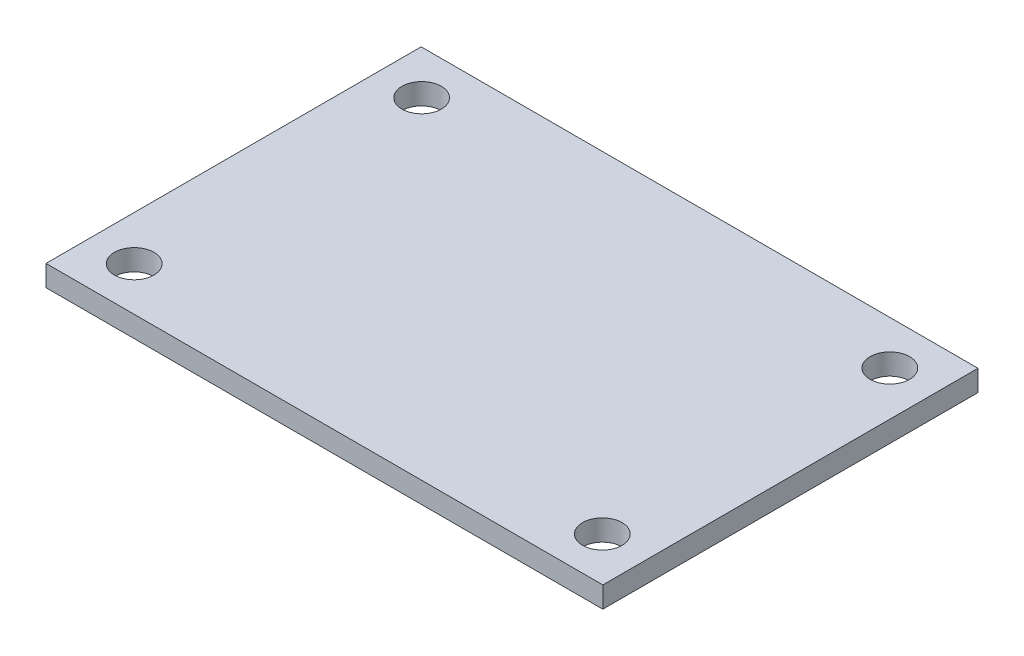
ISO-10303-21;
HEADER;
FILE_DESCRIPTION(('STEP AP214'),'2;1');
FILE_NAME('part.step','',(''),(''),'','','');
FILE_SCHEMA(('AUTOMOTIVE_DESIGN { 1 0 10303 214 1 1 1 1 }'));
ENDSEC;
DATA;
#1=APPLICATION_CONTEXT('core data for automotive mechanical design processes');
#2=APPLICATION_PROTOCOL_DEFINITION('international standard','automotive_design',2000,#1);
#3=PRODUCT_CONTEXT('',#1,'mechanical');
#4=PRODUCT('Part','Part','',(#3));
#5=PRODUCT_RELATED_PRODUCT_CATEGORY('part','',(#4));
#6=PRODUCT_DEFINITION_FORMATION('','',#4);
#7=PRODUCT_DEFINITION_CONTEXT('part definition',#1,'design');
#8=PRODUCT_DEFINITION('design','',#6,#7);
#9=PRODUCT_DEFINITION_SHAPE('','',#8);
#10=(LENGTH_UNIT() NAMED_UNIT(*) SI_UNIT(.MILLI.,.METRE.));
#11=(NAMED_UNIT(*) PLANE_ANGLE_UNIT() SI_UNIT($,.RADIAN.));
#12=(NAMED_UNIT(*) SI_UNIT($,.STERADIAN.) SOLID_ANGLE_UNIT());
#13=UNCERTAINTY_MEASURE_WITH_UNIT(LENGTH_MEASURE(1.E-05),#10,'distance_accuracy_value','');
#14=(GEOMETRIC_REPRESENTATION_CONTEXT(3) GLOBAL_UNCERTAINTY_ASSIGNED_CONTEXT((#13)) GLOBAL_UNIT_ASSIGNED_CONTEXT((#10,
#11,#12)) REPRESENTATION_CONTEXT('',''));
#15=CARTESIAN_POINT('',(0.,0.,0.));
#16=DIRECTION('',(0.,0.,1.));
#17=DIRECTION('',(1.,0.,0.));
#18=AXIS2_PLACEMENT_3D('',#15,#16,#17);
#19=CARTESIAN_POINT('',(0.,1.6,0.));
#20=DIRECTION('',(0.,1.,0.));
#21=DIRECTION('',(0.,0.,1.));
#22=AXIS2_PLACEMENT_3D('',#19,#20,#21);
#23=PLANE('',#22);
#24=CARTESIAN_POINT('',(17.7817,1.6,10.9198));
#25=DIRECTION('',(0.,1.,0.));
#26=DIRECTION('',(0.,0.,1.));
#27=AXIS2_PLACEMENT_3D('',#24,#25,#26);
#28=CIRCLE('',#27,1.5);
#29=CARTESIAN_POINT('',(17.7817,1.6,12.4198));
#30=VERTEX_POINT('',#29);
#31=EDGE_CURVE('E126',#30,#30,#28,.T.);
#32=ORIENTED_EDGE('',*,*,#31,.F.);
#33=EDGE_LOOP('',(#32));
#34=FACE_BOUND('',#33,.T.);
#35=CARTESIAN_POINT('',(-17.7817,1.6,-10.9198));
#36=DIRECTION('',(0.,1.,0.));
#37=DIRECTION('',(0.,0.,1.));
#38=AXIS2_PLACEMENT_3D('',#35,#36,#37);
#39=CIRCLE('',#38,1.5);
#40=CARTESIAN_POINT('',(-17.7817,1.6,-9.4198));
#41=VERTEX_POINT('',#40);
#42=EDGE_CURVE('E105',#41,#41,#39,.T.);
#43=ORIENTED_EDGE('',*,*,#42,.F.);
#44=EDGE_LOOP('',(#43));
#45=FACE_BOUND('',#44,.T.);
#46=DIRECTION('',(0.,0.,1.));
#47=VECTOR('',#46,1.);
#48=CARTESIAN_POINT('',(-21.15,1.6,14.25));
#49=LINE('',#48,#47);
#50=CARTESIAN_POINT('',(-21.15,1.6,-14.25));
#51=VERTEX_POINT('',#50);
#52=CARTESIAN_POINT('',(-21.15,1.6,14.25));
#53=VERTEX_POINT('',#52);
#54=EDGE_CURVE('E90',#51,#53,#49,.T.);
#55=ORIENTED_EDGE('',*,*,#54,.T.);
#56=DIRECTION('',(1.,0.,0.));
#57=VECTOR('',#56,1.);
#58=CARTESIAN_POINT('',(21.15,1.6,14.25));
#59=LINE('',#58,#57);
#60=CARTESIAN_POINT('',(21.15,1.6,14.25));
#61=VERTEX_POINT('',#60);
#62=EDGE_CURVE('E85',#53,#61,#59,.T.);
#63=ORIENTED_EDGE('',*,*,#62,.T.);
#64=DIRECTION('',(0.,0.,-1.));
#65=VECTOR('',#64,1.);
#66=CARTESIAN_POINT('',(21.15,1.6,14.25));
#67=LINE('',#66,#65);
#68=CARTESIAN_POINT('',(21.15,1.6,-14.25));
#69=VERTEX_POINT('',#68);
#70=EDGE_CURVE('E88',#61,#69,#67,.T.);
#71=ORIENTED_EDGE('',*,*,#70,.T.);
#72=DIRECTION('',(-1.,0.,0.));
#73=VECTOR('',#72,1.);
#74=CARTESIAN_POINT('',(21.15,1.6,-14.25));
#75=LINE('',#74,#73);
#76=EDGE_CURVE('E55',#69,#51,#75,.T.);
#77=ORIENTED_EDGE('',*,*,#76,.T.);
#78=EDGE_LOOP('',(#55,#63,#71,#77));
#79=FACE_BOUND('',#78,.T.);
#80=CARTESIAN_POINT('',(17.7817,1.6,-10.9198));
#81=DIRECTION('',(0.,1.,0.));
#82=DIRECTION('',(0.,0.,-1.));
#83=AXIS2_PLACEMENT_3D('',#80,#81,#82);
#84=CIRCLE('',#83,1.5);
#85=CARTESIAN_POINT('',(17.7817,1.6,-12.4198));
#86=VERTEX_POINT('',#85);
#87=EDGE_CURVE('E120',#86,#86,#84,.T.);
#88=ORIENTED_EDGE('',*,*,#87,.F.);
#89=EDGE_LOOP('',(#88));
#90=FACE_BOUND('',#89,.T.);
#91=CARTESIAN_POINT('',(-17.7817,1.6,10.9198));
#92=DIRECTION('',(0.,1.,0.));
#93=DIRECTION('',(0.,0.,-1.));
#94=AXIS2_PLACEMENT_3D('',#91,#92,#93);
#95=CIRCLE('',#94,1.5);
#96=CARTESIAN_POINT('',(-17.7817,1.6,9.41979999999999));
#97=VERTEX_POINT('',#96);
#98=EDGE_CURVE('E132',#97,#97,#95,.T.);
#99=ORIENTED_EDGE('',*,*,#98,.F.);
#100=EDGE_LOOP('',(#99));
#101=FACE_BOUND('',#100,.T.);
#102=ADVANCED_FACE('F38',(#34,#45,#79,#90,#101),#23,.T.);
#103=CARTESIAN_POINT('',(0.,0.,0.));
#104=DIRECTION('',(0.,1.,0.));
#105=DIRECTION('',(0.,0.,1.));
#106=AXIS2_PLACEMENT_3D('',#103,#104,#105);
#107=PLANE('',#106);
#108=DIRECTION('',(0.,0.,1.));
#109=VECTOR('',#108,1.);
#110=CARTESIAN_POINT('',(-21.15,0.,14.25));
#111=LINE('',#110,#109);
#112=CARTESIAN_POINT('',(-21.15,0.,-14.25));
#113=VERTEX_POINT('',#112);
#114=CARTESIAN_POINT('',(-21.15,0.,14.25));
#115=VERTEX_POINT('',#114);
#116=EDGE_CURVE('E102',#113,#115,#111,.T.);
#117=ORIENTED_EDGE('',*,*,#116,.F.);
#118=DIRECTION('',(-1.,0.,0.));
#119=VECTOR('',#118,1.);
#120=CARTESIAN_POINT('',(21.15,0.,-14.25));
#121=LINE('',#120,#119);
#122=CARTESIAN_POINT('',(21.15,0.,-14.25));
#123=VERTEX_POINT('',#122);
#124=EDGE_CURVE('E78',#123,#113,#121,.T.);
#125=ORIENTED_EDGE('',*,*,#124,.F.);
#126=DIRECTION('',(0.,0.,-1.));
#127=VECTOR('',#126,1.);
#128=CARTESIAN_POINT('',(21.15,0.,14.25));
#129=LINE('',#128,#127);
#130=CARTESIAN_POINT('',(21.15,0.,14.25));
#131=VERTEX_POINT('',#130);
#132=EDGE_CURVE('E72',#131,#123,#129,.T.);
#133=ORIENTED_EDGE('',*,*,#132,.F.);
#134=DIRECTION('',(1.,0.,0.));
#135=VECTOR('',#134,1.);
#136=CARTESIAN_POINT('',(21.15,0.,14.25));
#137=LINE('',#136,#135);
#138=EDGE_CURVE('E94',#115,#131,#137,.T.);
#139=ORIENTED_EDGE('',*,*,#138,.F.);
#140=EDGE_LOOP('',(#117,#125,#133,#139));
#141=FACE_BOUND('',#140,.T.);
#142=CARTESIAN_POINT('',(-17.7817,0.,-10.9198));
#143=DIRECTION('',(0.,1.,0.));
#144=DIRECTION('',(0.,0.,1.));
#145=AXIS2_PLACEMENT_3D('',#142,#143,#144);
#146=CIRCLE('',#145,1.5);
#147=CARTESIAN_POINT('',(-17.7817,0.,-9.4198));
#148=VERTEX_POINT('',#147);
#149=EDGE_CURVE('E117',#148,#148,#146,.T.);
#150=ORIENTED_EDGE('',*,*,#149,.T.);
#151=EDGE_LOOP('',(#150));
#152=FACE_BOUND('',#151,.T.);
#153=CARTESIAN_POINT('',(17.7817,0.,-10.9198));
#154=DIRECTION('',(0.,1.,0.));
#155=DIRECTION('',(0.,0.,-1.));
#156=AXIS2_PLACEMENT_3D('',#153,#154,#155);
#157=CIRCLE('',#156,1.5);
#158=CARTESIAN_POINT('',(17.7817,0.,-12.4198));
#159=VERTEX_POINT('',#158);
#160=EDGE_CURVE('E123',#159,#159,#157,.T.);
#161=ORIENTED_EDGE('',*,*,#160,.T.);
#162=EDGE_LOOP('',(#161));
#163=FACE_BOUND('',#162,.T.);
#164=CARTESIAN_POINT('',(17.7817,0.,10.9198));
#165=DIRECTION('',(0.,1.,0.));
#166=DIRECTION('',(0.,0.,1.));
#167=AXIS2_PLACEMENT_3D('',#164,#165,#166);
#168=CIRCLE('',#167,1.5);
#169=CARTESIAN_POINT('',(17.7817,0.,12.4198));
#170=VERTEX_POINT('',#169);
#171=EDGE_CURVE('E129',#170,#170,#168,.T.);
#172=ORIENTED_EDGE('',*,*,#171,.T.);
#173=EDGE_LOOP('',(#172));
#174=FACE_BOUND('',#173,.T.);
#175=CARTESIAN_POINT('',(-17.7817,0.,10.9198));
#176=DIRECTION('',(0.,1.,0.));
#177=DIRECTION('',(0.,0.,-1.));
#178=AXIS2_PLACEMENT_3D('',#175,#176,#177);
#179=CIRCLE('',#178,1.5);
#180=CARTESIAN_POINT('',(-17.7817,0.,9.41979999999999));
#181=VERTEX_POINT('',#180);
#182=EDGE_CURVE('E135',#181,#181,#179,.T.);
#183=ORIENTED_EDGE('',*,*,#182,.T.);
#184=EDGE_LOOP('',(#183));
#185=FACE_BOUND('',#184,.T.);
#186=ADVANCED_FACE('F113',(#141,#152,#163,#174,#185),#107,.F.);
#187=CARTESIAN_POINT('',(-21.15,1.6,14.25));
#188=DIRECTION('',(1.,0.,0.));
#189=DIRECTION('',(0.,0.,-1.));
#190=AXIS2_PLACEMENT_3D('',#187,#188,#189);
#191=PLANE('',#190);
#192=ORIENTED_EDGE('',*,*,#116,.T.);
#193=DIRECTION('',(0.,-1.,0.));
#194=VECTOR('',#193,1.);
#195=CARTESIAN_POINT('',(-21.15,1.6,14.25));
#196=LINE('',#195,#194);
#197=EDGE_CURVE('E11',#53,#115,#196,.T.);
#198=ORIENTED_EDGE('',*,*,#197,.F.);
#199=ORIENTED_EDGE('',*,*,#54,.F.);
#200=DIRECTION('',(0.,-1.,0.));
#201=VECTOR('',#200,1.);
#202=CARTESIAN_POINT('',(-21.15,1.6,-14.25));
#203=LINE('',#202,#201);
#204=EDGE_CURVE('E98',#51,#113,#203,.T.);
#205=ORIENTED_EDGE('',*,*,#204,.T.);
#206=EDGE_LOOP('',(#192,#198,#199,#205));
#207=FACE_BOUND('',#206,.T.);
#208=ADVANCED_FACE('F40',(#207),#191,.F.);
#209=CARTESIAN_POINT('',(21.15,1.6,14.25));
#210=DIRECTION('',(0.,0.,-1.));
#211=DIRECTION('',(-1.,0.,0.));
#212=AXIS2_PLACEMENT_3D('',#209,#210,#211);
#213=PLANE('',#212);
#214=ORIENTED_EDGE('',*,*,#138,.T.);
#215=DIRECTION('',(0.,-1.,0.));
#216=VECTOR('',#215,1.);
#217=CARTESIAN_POINT('',(21.15,1.6,14.25));
#218=LINE('',#217,#216);
#219=EDGE_CURVE('E47',#61,#131,#218,.T.);
#220=ORIENTED_EDGE('',*,*,#219,.F.);
#221=ORIENTED_EDGE('',*,*,#62,.F.);
#222=ORIENTED_EDGE('',*,*,#197,.T.);
#223=EDGE_LOOP('',(#214,#220,#221,#222));
#224=FACE_BOUND('',#223,.T.);
#225=ADVANCED_FACE('F93',(#224),#213,.F.);
#226=CARTESIAN_POINT('',(21.15,1.6,14.25));
#227=DIRECTION('',(-1.,0.,0.));
#228=DIRECTION('',(0.,0.,1.));
#229=AXIS2_PLACEMENT_3D('',#226,#227,#228);
#230=PLANE('',#229);
#231=ORIENTED_EDGE('',*,*,#132,.T.);
#232=DIRECTION('',(0.,-1.,0.));
#233=VECTOR('',#232,1.);
#234=CARTESIAN_POINT('',(21.15,1.6,-14.25));
#235=LINE('',#234,#233);
#236=EDGE_CURVE('E95',#69,#123,#235,.T.);
#237=ORIENTED_EDGE('',*,*,#236,.F.);
#238=ORIENTED_EDGE('',*,*,#70,.F.);
#239=ORIENTED_EDGE('',*,*,#219,.T.);
#240=EDGE_LOOP('',(#231,#237,#238,#239));
#241=FACE_BOUND('',#240,.T.);
#242=ADVANCED_FACE('F96',(#241),#230,.F.);
#243=CARTESIAN_POINT('',(21.15,1.6,-14.25));
#244=DIRECTION('',(0.,0.,1.));
#245=DIRECTION('',(1.,0.,0.));
#246=AXIS2_PLACEMENT_3D('',#243,#244,#245);
#247=PLANE('',#246);
#248=ORIENTED_EDGE('',*,*,#124,.T.);
#249=ORIENTED_EDGE('',*,*,#204,.F.);
#250=ORIENTED_EDGE('',*,*,#76,.F.);
#251=ORIENTED_EDGE('',*,*,#236,.T.);
#252=EDGE_LOOP('',(#248,#249,#250,#251));
#253=FACE_BOUND('',#252,.T.);
#254=ADVANCED_FACE('F110',(#253),#247,.F.);
#255=CARTESIAN_POINT('',(-17.7817,1.6,-10.9198));
#256=DIRECTION('',(0.,-1.,0.));
#257=DIRECTION('',(0.,0.,-1.));
#258=AXIS2_PLACEMENT_3D('',#255,#256,#257);
#259=CYLINDRICAL_SURFACE('',#258,1.5);
#260=ORIENTED_EDGE('',*,*,#42,.T.);
#261=EDGE_LOOP('',(#260));
#262=FACE_BOUND('',#261,.T.);
#263=ORIENTED_EDGE('',*,*,#149,.F.);
#264=EDGE_LOOP('',(#263));
#265=FACE_BOUND('',#264,.T.);
#266=ADVANCED_FACE('F154',(#262,#265),#259,.F.);
#267=CARTESIAN_POINT('',(17.7817,1.6,-10.9198));
#268=DIRECTION('',(0.,-1.,0.));
#269=DIRECTION('',(0.,0.,-1.));
#270=AXIS2_PLACEMENT_3D('',#267,#268,#269);
#271=CYLINDRICAL_SURFACE('',#270,1.5);
#272=ORIENTED_EDGE('',*,*,#87,.T.);
#273=EDGE_LOOP('',(#272));
#274=FACE_BOUND('',#273,.T.);
#275=ORIENTED_EDGE('',*,*,#160,.F.);
#276=EDGE_LOOP('',(#275));
#277=FACE_BOUND('',#276,.T.);
#278=ADVANCED_FACE('F202',(#274,#277),#271,.F.);
#279=CARTESIAN_POINT('',(17.7817,1.6,10.9198));
#280=DIRECTION('',(0.,-1.,0.));
#281=DIRECTION('',(0.,0.,-1.));
#282=AXIS2_PLACEMENT_3D('',#279,#280,#281);
#283=CYLINDRICAL_SURFACE('',#282,1.5);
#284=ORIENTED_EDGE('',*,*,#31,.T.);
#285=EDGE_LOOP('',(#284));
#286=FACE_BOUND('',#285,.T.);
#287=ORIENTED_EDGE('',*,*,#171,.F.);
#288=EDGE_LOOP('',(#287));
#289=FACE_BOUND('',#288,.T.);
#290=ADVANCED_FACE('F210',(#286,#289),#283,.F.);
#291=CARTESIAN_POINT('',(-17.7817,1.6,10.9198));
#292=DIRECTION('',(0.,-1.,0.));
#293=DIRECTION('',(0.,0.,-1.));
#294=AXIS2_PLACEMENT_3D('',#291,#292,#293);
#295=CYLINDRICAL_SURFACE('',#294,1.5);
#296=ORIENTED_EDGE('',*,*,#98,.T.);
#297=EDGE_LOOP('',(#296));
#298=FACE_BOUND('',#297,.T.);
#299=ORIENTED_EDGE('',*,*,#182,.F.);
#300=EDGE_LOOP('',(#299));
#301=FACE_BOUND('',#300,.T.);
#302=ADVANCED_FACE('F141',(#298,#301),#295,.F.);
#303=CLOSED_SHELL('',(#102,#186,#208,#225,#242,#254,#266,#278,#290,#302));
#304=MANIFOLD_SOLID_BREP('B2',#303);
#305=ADVANCED_BREP_SHAPE_REPRESENTATION('',(#18,#304),#14);
#306=SHAPE_DEFINITION_REPRESENTATION(#9,#305);
ENDSEC;
END-ISO-10303-21;
